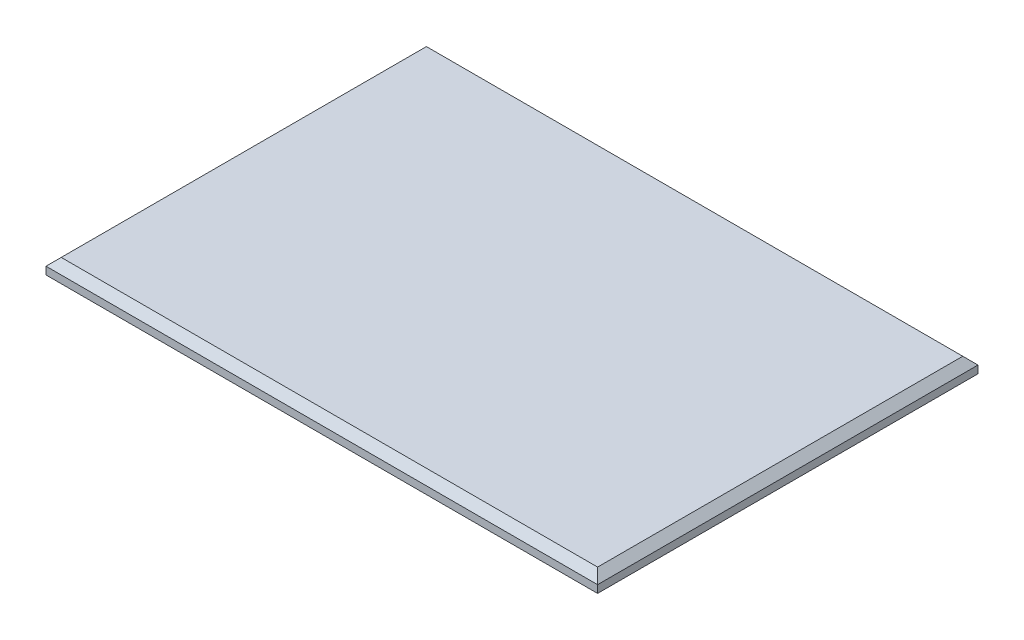
ISO-10303-21;
HEADER;
FILE_DESCRIPTION(('STEP AP214'),'2;1');
FILE_NAME('part.step','',(''),(''),'','','');
FILE_SCHEMA(('AUTOMOTIVE_DESIGN { 1 0 10303 214 1 1 1 1 }'));
ENDSEC;
DATA;
#1=APPLICATION_CONTEXT('core data for automotive mechanical design processes');
#2=APPLICATION_PROTOCOL_DEFINITION('international standard','automotive_design',2000,#1);
#3=PRODUCT_CONTEXT('',#1,'mechanical');
#4=PRODUCT('Part','Part','',(#3));
#5=PRODUCT_RELATED_PRODUCT_CATEGORY('part','',(#4));
#6=PRODUCT_DEFINITION_FORMATION('','',#4);
#7=PRODUCT_DEFINITION_CONTEXT('part definition',#1,'design');
#8=PRODUCT_DEFINITION('design','',#6,#7);
#9=PRODUCT_DEFINITION_SHAPE('','',#8);
#10=(LENGTH_UNIT() NAMED_UNIT(*) SI_UNIT(.MILLI.,.METRE.));
#11=(NAMED_UNIT(*) PLANE_ANGLE_UNIT() SI_UNIT($,.RADIAN.));
#12=(NAMED_UNIT(*) SI_UNIT($,.STERADIAN.) SOLID_ANGLE_UNIT());
#13=UNCERTAINTY_MEASURE_WITH_UNIT(LENGTH_MEASURE(1.E-05),#10,'distance_accuracy_value','');
#14=(GEOMETRIC_REPRESENTATION_CONTEXT(3) GLOBAL_UNCERTAINTY_ASSIGNED_CONTEXT((#13)) GLOBAL_UNIT_ASSIGNED_CONTEXT((#10,
#11,#12)) REPRESENTATION_CONTEXT('',''));
#15=CARTESIAN_POINT('',(0.,0.,0.));
#16=DIRECTION('',(0.,0.,1.));
#17=DIRECTION('',(1.,0.,0.));
#18=AXIS2_PLACEMENT_3D('',#15,#16,#17);
#19=CARTESIAN_POINT('',(72.5,3.99999999999999,-50.));
#20=DIRECTION('',(-1.,0.,0.));
#21=DIRECTION('',(0.,0.,1.));
#22=AXIS2_PLACEMENT_3D('',#19,#20,#21);
#23=PLANE('',#22);
#24=DIRECTION('',(0.,-1.,0.));
#25=VECTOR('',#24,1.);
#26=CARTESIAN_POINT('',(72.5,3.99999999999999,-50.));
#27=LINE('',#26,#25);
#28=CARTESIAN_POINT('',(72.5,1.99999999999996,-50.));
#29=VERTEX_POINT('',#28);
#30=CARTESIAN_POINT('',(72.5,0.,-50.));
#31=VERTEX_POINT('',#30);
#32=EDGE_CURVE('E94',#29,#31,#27,.T.);
#33=ORIENTED_EDGE('',*,*,#32,.F.);
#34=DIRECTION('',(0.,0.,1.));
#35=VECTOR('',#34,1.);
#36=CARTESIAN_POINT('',(72.5,1.99999999999996,50.));
#37=LINE('',#36,#35);
#38=CARTESIAN_POINT('',(72.5,1.99999999999996,50.));
#39=VERTEX_POINT('',#38);
#40=EDGE_CURVE('E152',#29,#39,#37,.T.);
#41=ORIENTED_EDGE('',*,*,#40,.T.);
#42=DIRECTION('',(0.,-1.,0.));
#43=VECTOR('',#42,1.);
#44=CARTESIAN_POINT('',(72.5,3.99999999999999,50.));
#45=LINE('',#44,#43);
#46=CARTESIAN_POINT('',(72.5,0.,50.));
#47=VERTEX_POINT('',#46);
#48=EDGE_CURVE('E116',#39,#47,#45,.T.);
#49=ORIENTED_EDGE('',*,*,#48,.T.);
#50=DIRECTION('',(0.,0.,-1.));
#51=VECTOR('',#50,1.);
#52=CARTESIAN_POINT('',(72.5,0.,-50.));
#53=LINE('',#52,#51);
#54=EDGE_CURVE('E110',#47,#31,#53,.T.);
#55=ORIENTED_EDGE('',*,*,#54,.T.);
#56=EDGE_LOOP('',(#33,#41,#49,#55));
#57=FACE_BOUND('',#56,.T.);
#58=ADVANCED_FACE('F41',(#57),#23,.F.);
#59=CARTESIAN_POINT('',(-72.5,3.99999999999999,-50.));
#60=DIRECTION('',(0.,0.,1.));
#61=DIRECTION('',(1.,0.,0.));
#62=AXIS2_PLACEMENT_3D('',#59,#60,#61);
#63=PLANE('',#62);
#64=DIRECTION('',(0.,-1.,0.));
#65=VECTOR('',#64,1.);
#66=CARTESIAN_POINT('',(-72.5,3.99999999999999,-50.));
#67=LINE('',#66,#65);
#68=CARTESIAN_POINT('',(-72.5,1.99999999999996,-50.));
#69=VERTEX_POINT('',#68);
#70=CARTESIAN_POINT('',(-72.5,0.,-50.));
#71=VERTEX_POINT('',#70);
#72=EDGE_CURVE('E104',#69,#71,#67,.T.);
#73=ORIENTED_EDGE('',*,*,#72,.F.);
#74=DIRECTION('',(1.,0.,0.));
#75=VECTOR('',#74,1.);
#76=CARTESIAN_POINT('',(72.5,1.99999999999996,-50.));
#77=LINE('',#76,#75);
#78=EDGE_CURVE('E52',#69,#29,#77,.T.);
#79=ORIENTED_EDGE('',*,*,#78,.T.);
#80=ORIENTED_EDGE('',*,*,#32,.T.);
#81=DIRECTION('',(-1.,0.,0.));
#82=VECTOR('',#81,1.);
#83=CARTESIAN_POINT('',(-72.5,0.,-50.));
#84=LINE('',#83,#82);
#85=EDGE_CURVE('E97',#31,#71,#84,.T.);
#86=ORIENTED_EDGE('',*,*,#85,.T.);
#87=EDGE_LOOP('',(#73,#79,#80,#86));
#88=FACE_BOUND('',#87,.T.);
#89=ADVANCED_FACE('F96',(#88),#63,.F.);
#90=CARTESIAN_POINT('',(-72.5,3.99999999999999,-50.));
#91=DIRECTION('',(1.,0.,0.));
#92=DIRECTION('',(0.,0.,-1.));
#93=AXIS2_PLACEMENT_3D('',#90,#91,#92);
#94=PLANE('',#93);
#95=DIRECTION('',(0.,-1.,0.));
#96=VECTOR('',#95,1.);
#97=CARTESIAN_POINT('',(-72.5,3.99999999999999,50.));
#98=LINE('',#97,#96);
#99=CARTESIAN_POINT('',(-72.5,1.99999999999996,50.));
#100=VERTEX_POINT('',#99);
#101=CARTESIAN_POINT('',(-72.5,0.,50.));
#102=VERTEX_POINT('',#101);
#103=EDGE_CURVE('E131',#100,#102,#98,.T.);
#104=ORIENTED_EDGE('',*,*,#103,.F.);
#105=DIRECTION('',(0.,0.,-1.));
#106=VECTOR('',#105,1.);
#107=CARTESIAN_POINT('',(-72.5,1.99999999999996,-50.));
#108=LINE('',#107,#106);
#109=EDGE_CURVE('E11',#100,#69,#108,.T.);
#110=ORIENTED_EDGE('',*,*,#109,.T.);
#111=ORIENTED_EDGE('',*,*,#72,.T.);
#112=DIRECTION('',(0.,0.,1.));
#113=VECTOR('',#112,1.);
#114=CARTESIAN_POINT('',(-72.5,0.,-50.));
#115=LINE('',#114,#113);
#116=EDGE_CURVE('E112',#71,#102,#115,.T.);
#117=ORIENTED_EDGE('',*,*,#116,.T.);
#118=EDGE_LOOP('',(#104,#110,#111,#117));
#119=FACE_BOUND('',#118,.T.);
#120=ADVANCED_FACE('F182',(#119),#94,.F.);
#121=CARTESIAN_POINT('',(-72.5,3.99999999999999,50.));
#122=DIRECTION('',(0.,0.,-1.));
#123=DIRECTION('',(-1.,0.,0.));
#124=AXIS2_PLACEMENT_3D('',#121,#122,#123);
#125=PLANE('',#124);
#126=ORIENTED_EDGE('',*,*,#48,.F.);
#127=DIRECTION('',(-1.,0.,0.));
#128=VECTOR('',#127,1.);
#129=CARTESIAN_POINT('',(-72.5,1.99999999999996,50.));
#130=LINE('',#129,#128);
#131=EDGE_CURVE('E148',#39,#100,#130,.T.);
#132=ORIENTED_EDGE('',*,*,#131,.T.);
#133=ORIENTED_EDGE('',*,*,#103,.T.);
#134=DIRECTION('',(1.,0.,0.));
#135=VECTOR('',#134,1.);
#136=CARTESIAN_POINT('',(-72.5,0.,50.));
#137=LINE('',#136,#135);
#138=EDGE_CURVE('E126',#102,#47,#137,.T.);
#139=ORIENTED_EDGE('',*,*,#138,.T.);
#140=EDGE_LOOP('',(#126,#132,#133,#139));
#141=FACE_BOUND('',#140,.T.);
#142=ADVANCED_FACE('F181',(#141),#125,.F.);
#143=CARTESIAN_POINT('',(0.,3.99999999999999,0.));
#144=DIRECTION('',(0.,1.,0.));
#145=DIRECTION('',(0.,0.,1.));
#146=AXIS2_PLACEMENT_3D('',#143,#144,#145);
#147=PLANE('',#146);
#148=DIRECTION('',(0.,0.,1.));
#149=VECTOR('',#148,1.);
#150=CARTESIAN_POINT('',(-70.5,3.99999999999999,50.));
#151=LINE('',#150,#149);
#152=CARTESIAN_POINT('',(-70.5,3.99999999999999,-48.));
#153=VERTEX_POINT('',#152);
#154=CARTESIAN_POINT('',(-70.5,3.99999999999999,48.));
#155=VERTEX_POINT('',#154);
#156=EDGE_CURVE('E103',#153,#155,#151,.T.);
#157=ORIENTED_EDGE('',*,*,#156,.T.);
#158=DIRECTION('',(1.,0.,0.));
#159=VECTOR('',#158,1.);
#160=CARTESIAN_POINT('',(72.5,3.99999999999999,48.));
#161=LINE('',#160,#159);
#162=CARTESIAN_POINT('',(70.5,3.99999999999999,48.));
#163=VERTEX_POINT('',#162);
#164=EDGE_CURVE('E144',#155,#163,#161,.T.);
#165=ORIENTED_EDGE('',*,*,#164,.T.);
#166=DIRECTION('',(0.,0.,-1.));
#167=VECTOR('',#166,1.);
#168=CARTESIAN_POINT('',(70.5,3.99999999999999,-50.));
#169=LINE('',#168,#167);
#170=CARTESIAN_POINT('',(70.5,3.99999999999999,-48.));
#171=VERTEX_POINT('',#170);
#172=EDGE_CURVE('E141',#163,#171,#169,.T.);
#173=ORIENTED_EDGE('',*,*,#172,.T.);
#174=DIRECTION('',(-1.,0.,0.));
#175=VECTOR('',#174,1.);
#176=CARTESIAN_POINT('',(-72.5,3.99999999999999,-48.));
#177=LINE('',#176,#175);
#178=EDGE_CURVE('E138',#171,#153,#177,.T.);
#179=ORIENTED_EDGE('',*,*,#178,.T.);
#180=EDGE_LOOP('',(#157,#165,#173,#179));
#181=FACE_BOUND('',#180,.T.);
#182=ADVANCED_FACE('F174',(#181),#147,.T.);
#183=CARTESIAN_POINT('',(0.,0.,0.));
#184=DIRECTION('',(0.,1.,0.));
#185=DIRECTION('',(0.,0.,1.));
#186=AXIS2_PLACEMENT_3D('',#183,#184,#185);
#187=PLANE('',#186);
#188=ORIENTED_EDGE('',*,*,#54,.F.);
#189=ORIENTED_EDGE('',*,*,#138,.F.);
#190=ORIENTED_EDGE('',*,*,#116,.F.);
#191=ORIENTED_EDGE('',*,*,#85,.F.);
#192=EDGE_LOOP('',(#188,#189,#190,#191));
#193=FACE_BOUND('',#192,.T.);
#194=ADVANCED_FACE('F108',(#193),#187,.F.);
#195=CARTESIAN_POINT('',(0.,3.99999999999999,-48.));
#196=DIRECTION('',(0.,0.707106781186545,-0.70710678118655));
#197=DIRECTION('',(1.,0.,0.));
#198=AXIS2_PLACEMENT_3D('',#195,#196,#197);
#199=PLANE('',#198);
#200=DIRECTION('',(0.577350269189623,-0.577350269189629,-0.577350269189625));
#201=VECTOR('',#200,1.);
#202=CARTESIAN_POINT('',(47.0000000000002,27.5,-24.5000000000001));
#203=LINE('',#202,#201);
#204=EDGE_CURVE('E122',#29,#171,#203,.F.);
#205=ORIENTED_EDGE('',*,*,#204,.F.);
#206=ORIENTED_EDGE('',*,*,#78,.F.);
#207=DIRECTION('',(-0.577350269189625,-0.577350269189629,-0.577350269189625));
#208=VECTOR('',#207,1.);
#209=CARTESIAN_POINT('',(-54.5000000000001,20.,-32.0000000000001));
#210=LINE('',#209,#208);
#211=EDGE_CURVE('E46',#153,#69,#210,.T.);
#212=ORIENTED_EDGE('',*,*,#211,.F.);
#213=ORIENTED_EDGE('',*,*,#178,.F.);
#214=EDGE_LOOP('',(#205,#206,#212,#213));
#215=FACE_BOUND('',#214,.T.);
#216=ADVANCED_FACE('F44',(#215),#199,.T.);
#217=CARTESIAN_POINT('',(-70.5,3.99999999999999,0.));
#218=DIRECTION('',(-0.70710678118655,0.707106781186545,0.));
#219=DIRECTION('',(0.,0.,-1.));
#220=AXIS2_PLACEMENT_3D('',#217,#218,#219);
#221=PLANE('',#220);
#222=ORIENTED_EDGE('',*,*,#211,.T.);
#223=ORIENTED_EDGE('',*,*,#109,.F.);
#224=DIRECTION('',(0.577350269189625,0.577350269189629,-0.577350269189625));
#225=VECTOR('',#224,1.);
#226=CARTESIAN_POINT('',(-54.5000000000001,20.,32.0000000000001));
#227=LINE('',#226,#225);
#228=EDGE_CURVE('E160',#155,#100,#227,.F.);
#229=ORIENTED_EDGE('',*,*,#228,.F.);
#230=ORIENTED_EDGE('',*,*,#156,.F.);
#231=EDGE_LOOP('',(#222,#223,#229,#230));
#232=FACE_BOUND('',#231,.T.);
#233=ADVANCED_FACE('F206',(#232),#221,.T.);
#234=CARTESIAN_POINT('',(70.5,3.99999999999999,0.));
#235=DIRECTION('',(0.707106781186551,0.707106781186544,0.));
#236=DIRECTION('',(0.,0.,1.));
#237=AXIS2_PLACEMENT_3D('',#234,#235,#236);
#238=PLANE('',#237);
#239=ORIENTED_EDGE('',*,*,#204,.T.);
#240=ORIENTED_EDGE('',*,*,#172,.F.);
#241=DIRECTION('',(0.577350269189623,-0.577350269189629,0.577350269189625));
#242=VECTOR('',#241,1.);
#243=CARTESIAN_POINT('',(54.5000000000001,20.0000000000001,32.));
#244=LINE('',#243,#242);
#245=EDGE_CURVE('E157',#39,#163,#244,.F.);
#246=ORIENTED_EDGE('',*,*,#245,.F.);
#247=ORIENTED_EDGE('',*,*,#40,.F.);
#248=EDGE_LOOP('',(#239,#240,#246,#247));
#249=FACE_BOUND('',#248,.T.);
#250=ADVANCED_FACE('F167',(#249),#238,.T.);
#251=CARTESIAN_POINT('',(0.,3.99999999999999,48.));
#252=DIRECTION('',(0.,0.707106781186545,0.70710678118655));
#253=DIRECTION('',(-1.,0.,0.));
#254=AXIS2_PLACEMENT_3D('',#251,#252,#253);
#255=PLANE('',#254);
#256=ORIENTED_EDGE('',*,*,#228,.T.);
#257=ORIENTED_EDGE('',*,*,#131,.F.);
#258=ORIENTED_EDGE('',*,*,#245,.T.);
#259=ORIENTED_EDGE('',*,*,#164,.F.);
#260=EDGE_LOOP('',(#256,#257,#258,#259));
#261=FACE_BOUND('',#260,.T.);
#262=ADVANCED_FACE('F178',(#261),#255,.T.);
#263=CLOSED_SHELL('',(#58,#89,#120,#142,#182,#194,#216,#233,#250,#262));
#264=MANIFOLD_SOLID_BREP('B2',#263);
#265=ADVANCED_BREP_SHAPE_REPRESENTATION('',(#18,#264),#14);
#266=SHAPE_DEFINITION_REPRESENTATION(#9,#265);
ENDSEC;
END-ISO-10303-21;
